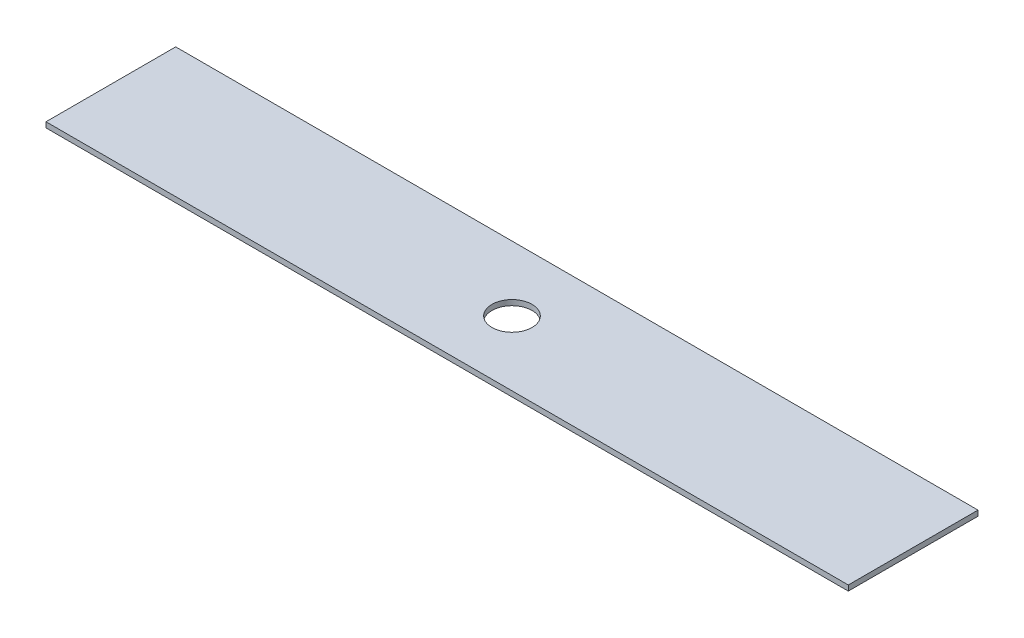
ISO-10303-21;
HEADER;
FILE_DESCRIPTION(('STEP AP214'),'2;1');
FILE_NAME('part.step','',(''),(''),'','','');
FILE_SCHEMA(('AUTOMOTIVE_DESIGN { 1 0 10303 214 1 1 1 1 }'));
ENDSEC;
DATA;
#1=APPLICATION_CONTEXT('core data for automotive mechanical design processes');
#2=APPLICATION_PROTOCOL_DEFINITION('international standard','automotive_design',2000,#1);
#3=PRODUCT_CONTEXT('',#1,'mechanical');
#4=PRODUCT('Part','Part','',(#3));
#5=PRODUCT_RELATED_PRODUCT_CATEGORY('part','',(#4));
#6=PRODUCT_DEFINITION_FORMATION('','',#4);
#7=PRODUCT_DEFINITION_CONTEXT('part definition',#1,'design');
#8=PRODUCT_DEFINITION('design','',#6,#7);
#9=PRODUCT_DEFINITION_SHAPE('','',#8);
#10=(LENGTH_UNIT() NAMED_UNIT(*) SI_UNIT(.MILLI.,.METRE.));
#11=(NAMED_UNIT(*) PLANE_ANGLE_UNIT() SI_UNIT($,.RADIAN.));
#12=(NAMED_UNIT(*) SI_UNIT($,.STERADIAN.) SOLID_ANGLE_UNIT());
#13=UNCERTAINTY_MEASURE_WITH_UNIT(LENGTH_MEASURE(1.E-05),#10,'distance_accuracy_value','');
#14=(GEOMETRIC_REPRESENTATION_CONTEXT(3) GLOBAL_UNCERTAINTY_ASSIGNED_CONTEXT((#13)) GLOBAL_UNIT_ASSIGNED_CONTEXT((#10,
#11,#12)) REPRESENTATION_CONTEXT('',''));
#15=CARTESIAN_POINT('',(0.,0.,0.));
#16=DIRECTION('',(0.,0.,1.));
#17=DIRECTION('',(1.,0.,0.));
#18=AXIS2_PLACEMENT_3D('',#15,#16,#17);
#19=CARTESIAN_POINT('',(-102.552346646343,2.,-9.09942181101667));
#20=DIRECTION('',(0.,0.,-1.));
#21=DIRECTION('',(-1.,0.,0.));
#22=AXIS2_PLACEMENT_3D('',#19,#20,#21);
#23=PLANE('',#22);
#24=DIRECTION('',(1.,0.,0.));
#25=VECTOR('',#24,1.);
#26=CARTESIAN_POINT('',(-102.552346646343,0.,-9.09942181101667));
#27=LINE('',#26,#25);
#28=CARTESIAN_POINT('',(-102.552346646343,0.,-9.09942181101667));
#29=VERTEX_POINT('',#28);
#30=CARTESIAN_POINT('',(197.447653353657,0.,-9.09942181101667));
#31=VERTEX_POINT('',#30);
#32=EDGE_CURVE('E99',#29,#31,#27,.T.);
#33=ORIENTED_EDGE('',*,*,#32,.F.);
#34=DIRECTION('',(0.,-1.,0.));
#35=VECTOR('',#34,1.);
#36=CARTESIAN_POINT('',(-102.552346646343,2.,-9.09942181101667));
#37=LINE('',#36,#35);
#38=CARTESIAN_POINT('',(-102.552346646343,2.,-9.09942181101667));
#39=VERTEX_POINT('',#38);
#40=EDGE_CURVE('E11',#39,#29,#37,.T.);
#41=ORIENTED_EDGE('',*,*,#40,.F.);
#42=DIRECTION('',(1.,0.,0.));
#43=VECTOR('',#42,1.);
#44=CARTESIAN_POINT('',(-102.552346646343,2.,-9.09942181101667));
#45=LINE('',#44,#43);
#46=CARTESIAN_POINT('',(197.447653353657,2.,-9.09942181101667));
#47=VERTEX_POINT('',#46);
#48=EDGE_CURVE('E93',#39,#47,#45,.T.);
#49=ORIENTED_EDGE('',*,*,#48,.T.);
#50=DIRECTION('',(0.,-1.,0.));
#51=VECTOR('',#50,1.);
#52=CARTESIAN_POINT('',(197.447653353657,2.,-9.09942181101667));
#53=LINE('',#52,#51);
#54=EDGE_CURVE('E36',#47,#31,#53,.T.);
#55=ORIENTED_EDGE('',*,*,#54,.T.);
#56=EDGE_LOOP('',(#33,#41,#49,#55));
#57=FACE_BOUND('',#56,.T.);
#58=ADVANCED_FACE('F33',(#57),#23,.T.);
#59=CARTESIAN_POINT('',(-102.552346646343,2.,-9.09942181101667));
#60=DIRECTION('',(1.,0.,0.));
#61=DIRECTION('',(0.,0.,-1.));
#62=AXIS2_PLACEMENT_3D('',#59,#60,#61);
#63=PLANE('',#62);
#64=DIRECTION('',(0.,0.,1.));
#65=VECTOR('',#64,1.);
#66=CARTESIAN_POINT('',(-102.552346646343,0.,-9.09942181101667));
#67=LINE('',#66,#65);
#68=CARTESIAN_POINT('',(-102.552346646343,0.,39.4005781889833));
#69=VERTEX_POINT('',#68);
#70=EDGE_CURVE('E66',#29,#69,#67,.T.);
#71=ORIENTED_EDGE('',*,*,#70,.T.);
#72=DIRECTION('',(0.,-1.,0.));
#73=VECTOR('',#72,1.);
#74=CARTESIAN_POINT('',(-102.552346646343,2.,39.4005781889833));
#75=LINE('',#74,#73);
#76=CARTESIAN_POINT('',(-102.552346646343,2.,39.4005781889833));
#77=VERTEX_POINT('',#76);
#78=EDGE_CURVE('E42',#77,#69,#75,.T.);
#79=ORIENTED_EDGE('',*,*,#78,.F.);
#80=DIRECTION('',(0.,0.,1.));
#81=VECTOR('',#80,1.);
#82=CARTESIAN_POINT('',(-102.552346646343,2.,-9.09942181101667));
#83=LINE('',#82,#81);
#84=EDGE_CURVE('E83',#39,#77,#83,.T.);
#85=ORIENTED_EDGE('',*,*,#84,.F.);
#86=ORIENTED_EDGE('',*,*,#40,.T.);
#87=EDGE_LOOP('',(#71,#79,#85,#86));
#88=FACE_BOUND('',#87,.T.);
#89=ADVANCED_FACE('F110',(#88),#63,.F.);
#90=CARTESIAN_POINT('',(-102.552346646343,2.,39.4005781889833));
#91=DIRECTION('',(0.,0.,-1.));
#92=DIRECTION('',(-1.,0.,0.));
#93=AXIS2_PLACEMENT_3D('',#90,#91,#92);
#94=PLANE('',#93);
#95=DIRECTION('',(1.,0.,0.));
#96=VECTOR('',#95,1.);
#97=CARTESIAN_POINT('',(-102.552346646343,0.,39.4005781889833));
#98=LINE('',#97,#96);
#99=CARTESIAN_POINT('',(197.447653353657,0.,39.4005781889833));
#100=VERTEX_POINT('',#99);
#101=EDGE_CURVE('E90',#69,#100,#98,.T.);
#102=ORIENTED_EDGE('',*,*,#101,.T.);
#103=DIRECTION('',(0.,-1.,0.));
#104=VECTOR('',#103,1.);
#105=CARTESIAN_POINT('',(197.447653353657,2.,39.4005781889833));
#106=LINE('',#105,#104);
#107=CARTESIAN_POINT('',(197.447653353657,2.,39.4005781889833));
#108=VERTEX_POINT('',#107);
#109=EDGE_CURVE('E87',#108,#100,#106,.T.);
#110=ORIENTED_EDGE('',*,*,#109,.F.);
#111=DIRECTION('',(1.,0.,0.));
#112=VECTOR('',#111,1.);
#113=CARTESIAN_POINT('',(-102.552346646343,2.,39.4005781889833));
#114=LINE('',#113,#112);
#115=EDGE_CURVE('E78',#77,#108,#114,.T.);
#116=ORIENTED_EDGE('',*,*,#115,.F.);
#117=ORIENTED_EDGE('',*,*,#78,.T.);
#118=EDGE_LOOP('',(#102,#110,#116,#117));
#119=FACE_BOUND('',#118,.T.);
#120=ADVANCED_FACE('F88',(#119),#94,.F.);
#121=CARTESIAN_POINT('',(197.447653353657,2.,-9.09942181101667));
#122=DIRECTION('',(1.,0.,0.));
#123=DIRECTION('',(0.,0.,-1.));
#124=AXIS2_PLACEMENT_3D('',#121,#122,#123);
#125=PLANE('',#124);
#126=DIRECTION('',(0.,0.,1.));
#127=VECTOR('',#126,1.);
#128=CARTESIAN_POINT('',(197.447653353657,0.,-9.09942181101667));
#129=LINE('',#128,#127);
#130=EDGE_CURVE('E102',#31,#100,#129,.T.);
#131=ORIENTED_EDGE('',*,*,#130,.F.);
#132=ORIENTED_EDGE('',*,*,#54,.F.);
#133=DIRECTION('',(0.,0.,1.));
#134=VECTOR('',#133,1.);
#135=CARTESIAN_POINT('',(197.447653353657,2.,-9.09942181101667));
#136=LINE('',#135,#134);
#137=EDGE_CURVE('E82',#47,#108,#136,.T.);
#138=ORIENTED_EDGE('',*,*,#137,.T.);
#139=ORIENTED_EDGE('',*,*,#109,.T.);
#140=EDGE_LOOP('',(#131,#132,#138,#139));
#141=FACE_BOUND('',#140,.T.);
#142=ADVANCED_FACE('F92',(#141),#125,.T.);
#143=CARTESIAN_POINT('',(0.,2.,0.));
#144=DIRECTION('',(0.,-1.,0.));
#145=DIRECTION('',(0.,0.,-1.));
#146=AXIS2_PLACEMENT_3D('',#143,#144,#145);
#147=PLANE('',#146);
#148=CARTESIAN_POINT('',(47.4476533536569,2.,15.1505781889833));
#149=DIRECTION('',(0.,1.,0.));
#150=DIRECTION('',(0.,0.,1.));
#151=AXIS2_PLACEMENT_3D('',#148,#149,#150);
#152=CIRCLE('',#151,7.5);
#153=CARTESIAN_POINT('',(47.4476533536569,2.,22.6505781889833));
#154=VERTEX_POINT('',#153);
#155=EDGE_CURVE('E141',#154,#154,#152,.T.);
#156=ORIENTED_EDGE('',*,*,#155,.F.);
#157=EDGE_LOOP('',(#156));
#158=FACE_BOUND('',#157,.T.);
#159=ORIENTED_EDGE('',*,*,#48,.F.);
#160=ORIENTED_EDGE('',*,*,#84,.T.);
#161=ORIENTED_EDGE('',*,*,#115,.T.);
#162=ORIENTED_EDGE('',*,*,#137,.F.);
#163=EDGE_LOOP('',(#159,#160,#161,#162));
#164=FACE_BOUND('',#163,.T.);
#165=ADVANCED_FACE('F81',(#158,#164),#147,.F.);
#166=CARTESIAN_POINT('',(0.,0.,0.));
#167=DIRECTION('',(0.,-1.,0.));
#168=DIRECTION('',(0.,0.,-1.));
#169=AXIS2_PLACEMENT_3D('',#166,#167,#168);
#170=PLANE('',#169);
#171=CARTESIAN_POINT('',(47.4476533536569,0.,15.1505781889833));
#172=DIRECTION('',(0.,1.,0.));
#173=DIRECTION('',(0.,0.,1.));
#174=AXIS2_PLACEMENT_3D('',#171,#172,#173);
#175=CIRCLE('',#174,7.5);
#176=CARTESIAN_POINT('',(47.4476533536569,0.,22.6505781889833));
#177=VERTEX_POINT('',#176);
#178=EDGE_CURVE('E103',#177,#177,#175,.T.);
#179=ORIENTED_EDGE('',*,*,#178,.T.);
#180=EDGE_LOOP('',(#179));
#181=FACE_BOUND('',#180,.T.);
#182=ORIENTED_EDGE('',*,*,#32,.T.);
#183=ORIENTED_EDGE('',*,*,#130,.T.);
#184=ORIENTED_EDGE('',*,*,#101,.F.);
#185=ORIENTED_EDGE('',*,*,#70,.F.);
#186=EDGE_LOOP('',(#182,#183,#184,#185));
#187=FACE_BOUND('',#186,.T.);
#188=ADVANCED_FACE('F108',(#181,#187),#170,.T.);
#189=CARTESIAN_POINT('',(47.4476533536569,0.,15.1505781889833));
#190=DIRECTION('',(0.,1.,0.));
#191=DIRECTION('',(0.,0.,1.));
#192=AXIS2_PLACEMENT_3D('',#189,#190,#191);
#193=CYLINDRICAL_SURFACE('',#192,7.5);
#194=ORIENTED_EDGE('',*,*,#178,.F.);
#195=EDGE_LOOP('',(#194));
#196=FACE_BOUND('',#195,.T.);
#197=ORIENTED_EDGE('',*,*,#155,.T.);
#198=EDGE_LOOP('',(#197));
#199=FACE_BOUND('',#198,.T.);
#200=ADVANCED_FACE('F129',(#196,#199),#193,.F.);
#201=CLOSED_SHELL('',(#58,#89,#120,#142,#165,#188,#200));
#202=MANIFOLD_SOLID_BREP('B2',#201);
#203=ADVANCED_BREP_SHAPE_REPRESENTATION('',(#18,#202),#14);
#204=SHAPE_DEFINITION_REPRESENTATION(#9,#203);
ENDSEC;
END-ISO-10303-21;
